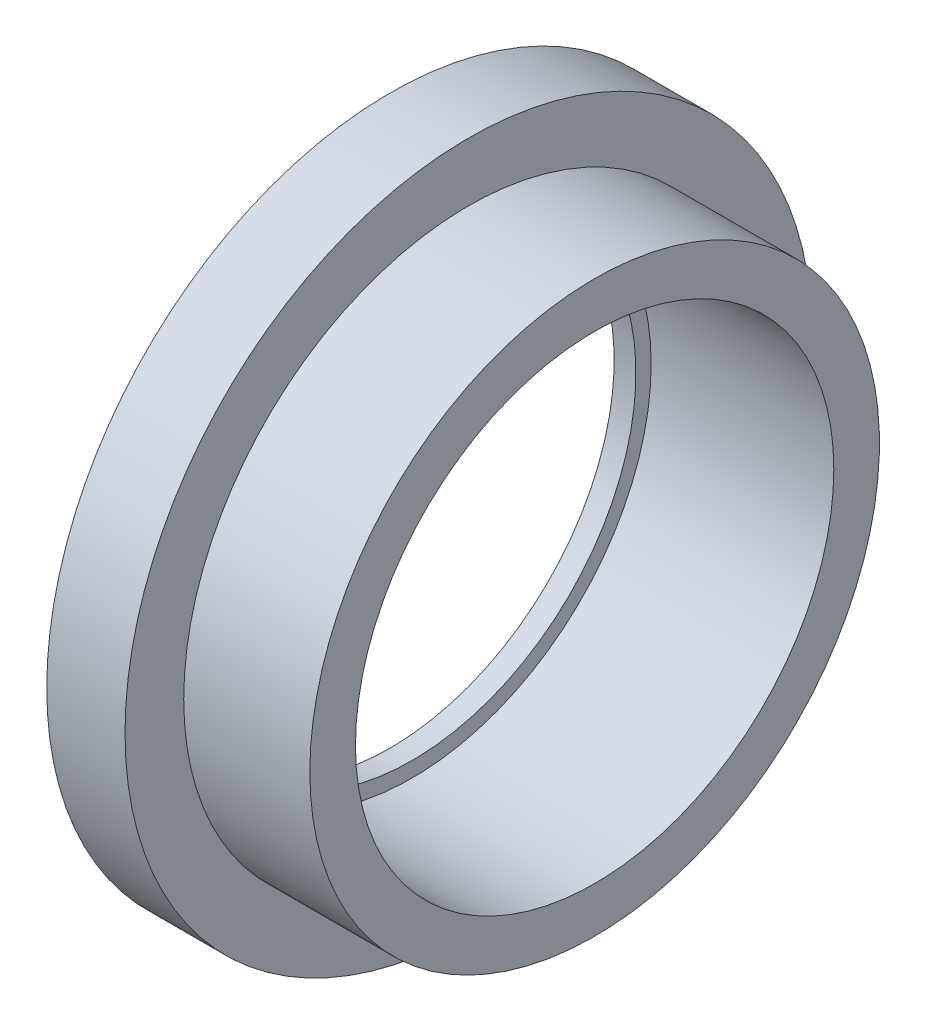
ISO-10303-21;
HEADER;
FILE_DESCRIPTION(('STEP AP214'),'2;1');
FILE_NAME('part.step','',(''),(''),'','','');
FILE_SCHEMA(('AUTOMOTIVE_DESIGN { 1 0 10303 214 1 1 1 1 }'));
ENDSEC;
DATA;
#1=APPLICATION_CONTEXT('core data for automotive mechanical design processes');
#2=APPLICATION_PROTOCOL_DEFINITION('international standard','automotive_design',2000,#1);
#3=PRODUCT_CONTEXT('',#1,'mechanical');
#4=PRODUCT('Part','Part','',(#3));
#5=PRODUCT_RELATED_PRODUCT_CATEGORY('part','',(#4));
#6=PRODUCT_DEFINITION_FORMATION('','',#4);
#7=PRODUCT_DEFINITION_CONTEXT('part definition',#1,'design');
#8=PRODUCT_DEFINITION('design','',#6,#7);
#9=PRODUCT_DEFINITION_SHAPE('','',#8);
#10=(LENGTH_UNIT() NAMED_UNIT(*) SI_UNIT(.MILLI.,.METRE.));
#11=(NAMED_UNIT(*) PLANE_ANGLE_UNIT() SI_UNIT($,.RADIAN.));
#12=(NAMED_UNIT(*) SI_UNIT($,.STERADIAN.) SOLID_ANGLE_UNIT());
#13=UNCERTAINTY_MEASURE_WITH_UNIT(LENGTH_MEASURE(1.E-05),#10,'distance_accuracy_value','');
#14=(GEOMETRIC_REPRESENTATION_CONTEXT(3) GLOBAL_UNCERTAINTY_ASSIGNED_CONTEXT((#13)) GLOBAL_UNIT_ASSIGNED_CONTEXT((#10,
#11,#12)) REPRESENTATION_CONTEXT('',''));
#15=CARTESIAN_POINT('',(0.,0.,0.));
#16=DIRECTION('',(0.,0.,1.));
#17=DIRECTION('',(1.,0.,0.));
#18=AXIS2_PLACEMENT_3D('',#15,#16,#17);
#19=CARTESIAN_POINT('',(13.,0.,0.));
#20=DIRECTION('',(-1.,0.,0.));
#21=DIRECTION('',(0.,0.,1.));
#22=AXIS2_PLACEMENT_3D('',#19,#20,#21);
#23=CYLINDRICAL_SURFACE('',#22,65.5);
#24=CARTESIAN_POINT('',(13.,0.,0.));
#25=DIRECTION('',(-1.,0.,0.));
#26=DIRECTION('',(0.,0.,1.));
#27=AXIS2_PLACEMENT_3D('',#24,#25,#26);
#28=CIRCLE('',#27,65.5);
#29=CARTESIAN_POINT('',(13.,0.,65.5));
#30=VERTEX_POINT('',#29);
#31=EDGE_CURVE('E38',#30,#30,#28,.T.);
#32=ORIENTED_EDGE('',*,*,#31,.F.);
#33=EDGE_LOOP('',(#32));
#34=FACE_BOUND('',#33,.T.);
#35=CARTESIAN_POINT('',(42.,0.,0.));
#36=DIRECTION('',(-1.,0.,0.));
#37=DIRECTION('',(0.,0.,1.));
#38=AXIS2_PLACEMENT_3D('',#35,#36,#37);
#39=CIRCLE('',#38,65.5);
#40=CARTESIAN_POINT('',(42.,0.,65.5));
#41=VERTEX_POINT('',#40);
#42=EDGE_CURVE('E16',#41,#41,#39,.F.);
#43=ORIENTED_EDGE('',*,*,#42,.F.);
#44=EDGE_LOOP('',(#43));
#45=FACE_BOUND('',#44,.T.);
#46=ADVANCED_FACE('F13',(#34,#45),#23,.T.);
#47=CARTESIAN_POINT('',(42.,65.5,66.286002108556));
#48=DIRECTION('',(1.,0.,0.));
#49=DIRECTION('',(0.,-1.,0.));
#50=AXIS2_PLACEMENT_3D('',#47,#48,#49);
#51=PLANE('',#50);
#52=CARTESIAN_POINT('',(42.,0.,0.));
#53=DIRECTION('',(-1.,0.,0.));
#54=DIRECTION('',(0.,0.,1.));
#55=AXIS2_PLACEMENT_3D('',#52,#53,#54);
#56=CIRCLE('',#55,55.);
#57=CARTESIAN_POINT('',(42.,0.,55.));
#58=VERTEX_POINT('',#57);
#59=EDGE_CURVE('E36',#58,#58,#56,.F.);
#60=ORIENTED_EDGE('',*,*,#59,.F.);
#61=EDGE_LOOP('',(#60));
#62=FACE_BOUND('',#61,.T.);
#63=ORIENTED_EDGE('',*,*,#42,.T.);
#64=EDGE_LOOP('',(#63));
#65=FACE_BOUND('',#64,.T.);
#66=ADVANCED_FACE('F45',(#62,#65),#51,.T.);
#67=CARTESIAN_POINT('',(13.,79.,79.9480031625341));
#68=DIRECTION('',(1.,0.,0.));
#69=DIRECTION('',(0.,-1.,0.));
#70=AXIS2_PLACEMENT_3D('',#67,#68,#69);
#71=PLANE('',#70);
#72=ORIENTED_EDGE('',*,*,#31,.T.);
#73=EDGE_LOOP('',(#72));
#74=FACE_BOUND('',#73,.T.);
#75=CARTESIAN_POINT('',(13.,0.,0.));
#76=DIRECTION('',(-1.,0.,0.));
#77=DIRECTION('',(0.,0.,1.));
#78=AXIS2_PLACEMENT_3D('',#75,#76,#77);
#79=CIRCLE('',#78,79.);
#80=CARTESIAN_POINT('',(13.,0.,79.));
#81=VERTEX_POINT('',#80);
#82=EDGE_CURVE('E33',#81,#81,#79,.T.);
#83=ORIENTED_EDGE('',*,*,#82,.F.);
#84=EDGE_LOOP('',(#83));
#85=FACE_BOUND('',#84,.T.);
#86=ADVANCED_FACE('F53',(#74,#85),#71,.T.);
#87=CARTESIAN_POINT('',(42.,0.,0.));
#88=DIRECTION('',(-1.,0.,0.));
#89=DIRECTION('',(0.,0.,1.));
#90=AXIS2_PLACEMENT_3D('',#87,#88,#89);
#91=CYLINDRICAL_SURFACE('',#90,55.);
#92=ORIENTED_EDGE('',*,*,#59,.T.);
#93=EDGE_LOOP('',(#92));
#94=FACE_BOUND('',#93,.T.);
#95=CARTESIAN_POINT('',(0.,0.,0.));
#96=DIRECTION('',(-1.,0.,0.));
#97=DIRECTION('',(0.,0.,1.));
#98=AXIS2_PLACEMENT_3D('',#95,#96,#97);
#99=CIRCLE('',#98,55.);
#100=CARTESIAN_POINT('',(0.,0.,55.));
#101=VERTEX_POINT('',#100);
#102=EDGE_CURVE('E30',#101,#101,#99,.F.);
#103=ORIENTED_EDGE('',*,*,#102,.F.);
#104=EDGE_LOOP('',(#103));
#105=FACE_BOUND('',#104,.T.);
#106=ADVANCED_FACE('F73',(#94,#105),#91,.F.);
#107=CARTESIAN_POINT('',(-5.,0.,0.));
#108=DIRECTION('',(-1.,0.,0.));
#109=DIRECTION('',(0.,0.,1.));
#110=AXIS2_PLACEMENT_3D('',#107,#108,#109);
#111=CYLINDRICAL_SURFACE('',#110,79.);
#112=CARTESIAN_POINT('',(-5.,0.,0.));
#113=DIRECTION('',(-1.,0.,0.));
#114=DIRECTION('',(0.,0.,1.));
#115=AXIS2_PLACEMENT_3D('',#112,#113,#114);
#116=CIRCLE('',#115,79.);
#117=CARTESIAN_POINT('',(-5.,0.,79.));
#118=VERTEX_POINT('',#117);
#119=EDGE_CURVE('E25',#118,#118,#116,.T.);
#120=ORIENTED_EDGE('',*,*,#119,.F.);
#121=EDGE_LOOP('',(#120));
#122=FACE_BOUND('',#121,.T.);
#123=ORIENTED_EDGE('',*,*,#82,.T.);
#124=EDGE_LOOP('',(#123));
#125=FACE_BOUND('',#124,.T.);
#126=ADVANCED_FACE('F69',(#122,#125),#111,.T.);
#127=CARTESIAN_POINT('',(0.,55.,55.6600021081709));
#128=DIRECTION('',(1.,0.,0.));
#129=DIRECTION('',(0.,-1.,0.));
#130=AXIS2_PLACEMENT_3D('',#127,#128,#129);
#131=PLANE('',#130);
#132=CARTESIAN_POINT('',(0.,0.,0.));
#133=DIRECTION('',(-1.,0.,0.));
#134=DIRECTION('',(0.,0.,1.));
#135=AXIS2_PLACEMENT_3D('',#132,#133,#134);
#136=CIRCLE('',#135,51.5);
#137=CARTESIAN_POINT('',(0.,0.,51.5));
#138=VERTEX_POINT('',#137);
#139=EDGE_CURVE('E20',#138,#138,#136,.F.);
#140=ORIENTED_EDGE('',*,*,#139,.F.);
#141=EDGE_LOOP('',(#140));
#142=FACE_BOUND('',#141,.T.);
#143=ORIENTED_EDGE('',*,*,#102,.T.);
#144=EDGE_LOOP('',(#143));
#145=FACE_BOUND('',#144,.T.);
#146=ADVANCED_FACE('F63',(#142,#145),#131,.T.);
#147=CARTESIAN_POINT('',(-5.,-79.,79.9480031625361));
#148=DIRECTION('',(-1.,0.,0.));
#149=DIRECTION('',(0.,1.,0.));
#150=AXIS2_PLACEMENT_3D('',#147,#148,#149);
#151=PLANE('',#150);
#152=CARTESIAN_POINT('',(-5.,0.,0.));
#153=DIRECTION('',(-1.,0.,0.));
#154=DIRECTION('',(0.,0.,1.));
#155=AXIS2_PLACEMENT_3D('',#152,#153,#154);
#156=CIRCLE('',#155,51.5);
#157=CARTESIAN_POINT('',(-5.,0.,51.5));
#158=VERTEX_POINT('',#157);
#159=EDGE_CURVE('E8',#158,#158,#156,.T.);
#160=ORIENTED_EDGE('',*,*,#159,.F.);
#161=EDGE_LOOP('',(#160));
#162=FACE_BOUND('',#161,.T.);
#163=ORIENTED_EDGE('',*,*,#119,.T.);
#164=EDGE_LOOP('',(#163));
#165=FACE_BOUND('',#164,.T.);
#166=ADVANCED_FACE('F57',(#162,#165),#151,.T.);
#167=CARTESIAN_POINT('',(0.,0.,0.));
#168=DIRECTION('',(-1.,0.,0.));
#169=DIRECTION('',(0.,0.,1.));
#170=AXIS2_PLACEMENT_3D('',#167,#168,#169);
#171=CYLINDRICAL_SURFACE('',#170,51.5);
#172=ORIENTED_EDGE('',*,*,#139,.T.);
#173=EDGE_LOOP('',(#172));
#174=FACE_BOUND('',#173,.T.);
#175=ORIENTED_EDGE('',*,*,#159,.T.);
#176=EDGE_LOOP('',(#175));
#177=FACE_BOUND('',#176,.T.);
#178=ADVANCED_FACE('F55',(#174,#177),#171,.F.);
#179=CLOSED_SHELL('',(#46,#66,#86,#106,#126,#146,#166,#178));
#180=MANIFOLD_SOLID_BREP('B1',#179);
#181=ADVANCED_BREP_SHAPE_REPRESENTATION('',(#18,#180),#14);
#182=SHAPE_DEFINITION_REPRESENTATION(#9,#181);
ENDSEC;
END-ISO-10303-21;
